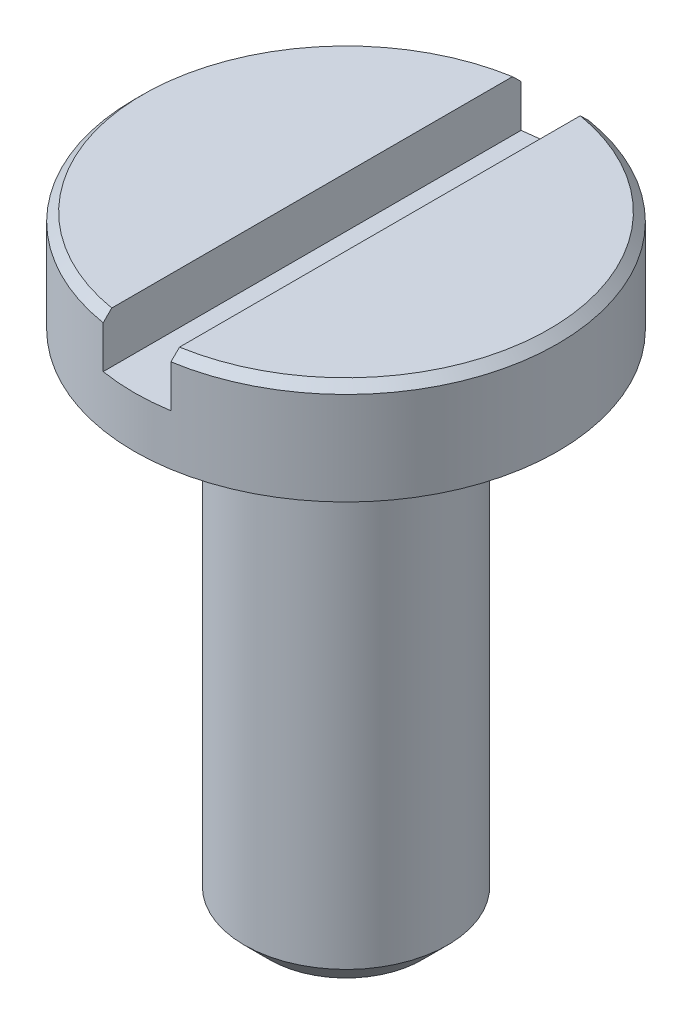
ISO-10303-21;
HEADER;
FILE_DESCRIPTION(('STEP AP214'),'2;1');
FILE_NAME('part.step','',(''),(''),'','','');
FILE_SCHEMA(('AUTOMOTIVE_DESIGN { 1 0 10303 214 1 1 1 1 }'));
ENDSEC;
DATA;
#1=APPLICATION_CONTEXT('core data for automotive mechanical design processes');
#2=APPLICATION_PROTOCOL_DEFINITION('international standard','automotive_design',2000,#1);
#3=PRODUCT_CONTEXT('',#1,'mechanical');
#4=PRODUCT('Part','Part','',(#3));
#5=PRODUCT_RELATED_PRODUCT_CATEGORY('part','',(#4));
#6=PRODUCT_DEFINITION_FORMATION('','',#4);
#7=PRODUCT_DEFINITION_CONTEXT('part definition',#1,'design');
#8=PRODUCT_DEFINITION('design','',#6,#7);
#9=PRODUCT_DEFINITION_SHAPE('','',#8);
#10=(LENGTH_UNIT() NAMED_UNIT(*) SI_UNIT(.MILLI.,.METRE.));
#11=(NAMED_UNIT(*) PLANE_ANGLE_UNIT() SI_UNIT($,.RADIAN.));
#12=(NAMED_UNIT(*) SI_UNIT($,.STERADIAN.) SOLID_ANGLE_UNIT());
#13=UNCERTAINTY_MEASURE_WITH_UNIT(LENGTH_MEASURE(1.E-05),#10,'distance_accuracy_value','');
#14=(GEOMETRIC_REPRESENTATION_CONTEXT(3) GLOBAL_UNCERTAINTY_ASSIGNED_CONTEXT((#13)) GLOBAL_UNIT_ASSIGNED_CONTEXT((#10,
#11,#12)) REPRESENTATION_CONTEXT('',''));
#15=CARTESIAN_POINT('',(0.,0.,0.));
#16=DIRECTION('',(0.,0.,1.));
#17=DIRECTION('',(1.,0.,0.));
#18=AXIS2_PLACEMENT_3D('',#15,#16,#17);
#19=CARTESIAN_POINT('',(0.,0.6,0.));
#20=DIRECTION('',(0.,1.,0.));
#21=DIRECTION('',(0.,0.,1.));
#22=AXIS2_PLACEMENT_3D('',#19,#20,#21);
#23=PLANE('',#22);
#24=DIRECTION('',(0.,0.,1.));
#25=VECTOR('',#24,1.);
#26=CARTESIAN_POINT('',(0.2,0.600000000000045,-1.25));
#27=LINE('',#26,#25);
#28=CARTESIAN_POINT('',(0.2,0.599999999999823,-1.18321595661988));
#29=VERTEX_POINT('',#28);
#30=CARTESIAN_POINT('',(0.2,0.599999999999823,1.18321595661988));
#31=VERTEX_POINT('',#30);
#32=EDGE_CURVE('E103',#29,#31,#27,.T.);
#33=ORIENTED_EDGE('',*,*,#32,.T.);
#34=CARTESIAN_POINT('',(0.,0.6,0.));
#35=DIRECTION('',(0.,1.,0.));
#36=DIRECTION('',(0.,0.,1.));
#37=AXIS2_PLACEMENT_3D('',#34,#35,#36);
#38=CIRCLE('',#37,1.2);
#39=EDGE_CURVE('E106',#31,#29,#38,.T.);
#40=ORIENTED_EDGE('',*,*,#39,.T.);
#41=EDGE_LOOP('',(#33,#40));
#42=FACE_BOUND('',#41,.T.);
#43=ADVANCED_FACE('F35',(#42),#23,.T.);
#44=CARTESIAN_POINT('',(0.,0.6,0.));
#45=DIRECTION('',(0.,-1.,0.));
#46=DIRECTION('',(0.,0.,-1.));
#47=AXIS2_PLACEMENT_3D('',#44,#45,#46);
#48=CONICAL_SURFACE('',#47,1.2,0.78539816339744);
#49=CARTESIAN_POINT('',(0.199999999999886,-0.950499970006001,2.74321892764739));
#50=CARTESIAN_POINT('',(0.199999999999893,-0.85521316276541,2.64767704238701));
#51=CARTESIAN_POINT('',(0.1999999999999,-0.759937513567608,2.55212401485427));
#52=CARTESIAN_POINT('',(0.199999999999914,-0.569420508066631,2.36097790814377));
#53=CARTESIAN_POINT('',(0.199999999999921,-0.474179152911256,2.26538482782206));
#54=CARTESIAN_POINT('',(0.199999999999935,-0.283680304847637,2.07407816347467));
#55=CARTESIAN_POINT('',(0.199999999999942,-0.188422849350493,1.97836454219386));
#56=CARTESIAN_POINT('',(0.199999999999956,0.00200973831289437,1.78686111472408));
#57=CARTESIAN_POINT('',(0.199999999999963,0.0971848728654708,1.69107131090932));
#58=CARTESIAN_POINT('',(0.199999999999977,0.286387712769196,1.50038687319419));
#59=CARTESIAN_POINT('',(0.199999999999984,0.38041680718345,1.40549361733739));
#60=CARTESIAN_POINT('',(0.199999999999998,0.568262322848238,1.2154799344842));
#61=CARTESIAN_POINT('',(0.200000000000005,0.662078724758933,1.12035948832674));
#62=CARTESIAN_POINT('',(0.200000000000015,0.802431191240111,0.977355461478562));
#63=CARTESIAN_POINT('',(0.200000000000018,0.849142887972829,0.929644297742755));
#64=CARTESIAN_POINT('',(0.200000000000025,0.942382748915012,0.834039211918449));
#65=CARTESIAN_POINT('',(0.200000000000029,0.988910906648579,0.786145283496622));
#66=CARTESIAN_POINT('',(0.200000000000035,1.08164699901678,0.690063753270319));
#67=CARTESIAN_POINT('',(0.200000000000039,1.12785498423148,0.641876200221872));
#68=CARTESIAN_POINT('',(0.200000000000046,1.21970773528638,0.544967994387595));
#69=CARTESIAN_POINT('',(0.200000000000049,1.26535254461765,0.496247383322212));
#70=CARTESIAN_POINT('',(0.200000000000053,1.32266782210179,0.433444864484505));
#71=CARTESIAN_POINT('',(0.200000000000054,1.33493377902086,0.41990768719576));
#72=CARTESIAN_POINT('',(0.200000000000056,1.35933321361233,0.392712938428519));
#73=CARTESIAN_POINT('',(0.200000000000057,1.37146668408859,0.37905536048243));
#74=CARTESIAN_POINT('',(0.200000000000059,1.40767513658386,0.337781215528018));
#75=CARTESIAN_POINT('',(0.200000000000061,1.43149053909029,0.309936528051617));
#76=CARTESIAN_POINT('',(0.200000000000064,1.47559765273767,0.255861694886954));
#77=CARTESIAN_POINT('',(0.200000000000066,1.49600843610721,0.229732167365978));
#78=CARTESIAN_POINT('',(0.200000000000068,1.52480518477775,0.18925858421655));
#79=CARTESIAN_POINT('',(0.200000000000069,1.53409437988248,0.175565259020838));
#80=CARTESIAN_POINT('',(0.20000000000007,1.55169168328672,0.147569344104482));
#81=CARTESIAN_POINT('',(0.200000000000071,1.56000099641343,0.133267532647374));
#82=CARTESIAN_POINT('',(0.200000000000072,1.57397551284466,0.105858050008022));
#83=CARTESIAN_POINT('',(0.200000000000072,1.57984745678161,0.0928587110503665));
#84=CARTESIAN_POINT('',(0.200000000000073,1.58969907939955,0.0661702015609263));
#85=CARTESIAN_POINT('',(0.200000000000073,1.5936851853496,0.0524835525617087));
#86=CARTESIAN_POINT('',(0.200000000000073,1.59850989657148,0.0269560064246883));
#87=CARTESIAN_POINT('',(0.200000000000073,1.59976945470394,0.0151985688248418));
#88=CARTESIAN_POINT('',(0.200000000000073,1.6001718043307,-0.00834316835147601));
#89=CARTESIAN_POINT('',(0.200000000000073,1.59931663499625,-0.0201274311120454));
#90=CARTESIAN_POINT('',(0.200000000000073,1.59516364543238,-0.046632359813152));
#91=CARTESIAN_POINT('',(0.200000000000073,1.5912493309678,-0.0612520830681338));
#92=CARTESIAN_POINT('',(0.200000000000072,1.58120047527907,-0.0897419347255407));
#93=CARTESIAN_POINT('',(0.200000000000072,1.57505325105002,-0.103607250128446));
#94=CARTESIAN_POINT('',(0.20000000000007,1.55683264697266,-0.139694012116542));
#95=CARTESIAN_POINT('',(0.200000000000069,1.54354967220904,-0.161283560008565));
#96=CARTESIAN_POINT('',(0.200000000000067,1.51522821534032,-0.203300232330449));
#97=CARTESIAN_POINT('',(0.200000000000066,1.50018421600613,-0.223723388178584));
#98=CARTESIAN_POINT('',(0.200000000000064,1.46906691381076,-0.263969274956352));
#99=CARTESIAN_POINT('',(0.200000000000063,1.45298784001529,-0.283787531009127));
#100=CARTESIAN_POINT('',(0.20000000000006,1.42030678861812,-0.322925503867143));
#101=CARTESIAN_POINT('',(0.200000000000059,1.40370572078283,-0.342245991712319));
#102=CARTESIAN_POINT('',(0.200000000000055,1.35391149998313,-0.399168778706729));
#103=CARTESIAN_POINT('',(0.200000000000053,1.32023024750236,-0.436342661674309));
#104=CARTESIAN_POINT('',(0.200000000000048,1.25224993849167,-0.510122852082956));
#105=CARTESIAN_POINT('',(0.200000000000045,1.2179507934654,-0.546729076802649));
#106=CARTESIAN_POINT('',(0.200000000000038,1.11448679964718,-0.656131274565132));
#107=CARTESIAN_POINT('',(0.200000000000033,1.04481402839601,-0.728446418955601));
#108=CARTESIAN_POINT('',(0.200000000000022,0.905416537934306,-0.872097092656359));
#109=CARTESIAN_POINT('',(0.200000000000017,0.835695199711297,-0.943435937459824));
#110=CARTESIAN_POINT('',(0.200000000000007,0.696002437153473,-1.08581877039426));
#111=CARTESIAN_POINT('',(0.200000000000002,0.626031111422726,-1.15686285505253));
#112=CARTESIAN_POINT('',(0.199999999999988,0.431455983866753,-1.35400414808119));
#113=CARTESIAN_POINT('',(0.199999999999979,0.306690384091999,-1.479941330513));
#114=CARTESIAN_POINT('',(0.19999999999996,0.0569299687690576,-1.73162420971081));
#115=CARTESIAN_POINT('',(0.199999999999951,-0.0680648773181554,-1.85736987615098));
#116=CARTESIAN_POINT('',(0.199999999999932,-0.319268602224971,-2.10984934365665));
#117=CARTESIAN_POINT('',(0.199999999999923,-0.445478504131675,-2.23658212643035));
#118=CARTESIAN_POINT('',(0.199999999999905,-0.697953823574084,-2.48995468743666));
#119=CARTESIAN_POINT('',(0.199999999999895,-0.824219230009358,-2.61659447672912));
#120=CARTESIAN_POINT('',(0.199999999999886,-0.950499970006002,-2.74321892764739));
#121=B_SPLINE_CURVE_WITH_KNOTS('',3,(#49,#50,#51,#52,#53,#54,#55,#56,#57,#58,#59,#60,#61,#62,
#63,#64,#65,#66,#67,#68,#69,#70,#71,#72,#73,#74,#75,#76,#77,#78,#79,#80,#81,#82,#83,#84,#85,#86,
#87,#88,#89,#90,#91,#92,#93,#94,#95,#96,#97,#98,#99,#100,#101,#102,#103,#104,#105,#106,#107,
#108,#109,#110,#111,#112,#113,#114,#115,#116,#117,#118,#119,#120),.UNSPECIFIED.,.F.,.F.,(4,2,2,
2,2,2,2,2,2,2,2,2,2,2,2,2,2,2,2,2,2,2,2,2,2,2,2,2,2,2,2,2,2,2,2,4),(0.,0.404809164288337,
0.809630808762067,1.21474277534173,1.61984257605578,2.02061153496668,2.42141558044582,
2.62172776074122,2.82204694664155,3.02233373006713,3.22260494836593,3.27740738256669,
3.33221277876293,3.44212264151892,3.5415107428698,3.59112809830151,3.64068379549018,
3.68338714841375,3.72594389320615,3.76124040239818,3.79650288944921,3.84163164166431,
3.88702084104461,3.96284904578586,4.03892151808884,4.11546271203283,4.19187718783774,
4.34234648879889,4.492837514494,4.79408069891004,5.0933346910438,5.39248141313244,
5.92430771282928,6.45621092333727,6.99278449758335,7.52927796906916),.UNSPECIFIED.);
#122=CARTESIAN_POINT('',(0.199999999999996,0.549999999999998,1.23389626792531));
#123=VERTEX_POINT('',#122);
#124=EDGE_CURVE('E173',#123,#31,#121,.T.);
#125=ORIENTED_EDGE('',*,*,#124,.F.);
#126=CARTESIAN_POINT('',(0.,0.549999999999998,0.));
#127=DIRECTION('',(0.,1.,0.));
#128=DIRECTION('',(0.,0.,1.));
#129=AXIS2_PLACEMENT_3D('',#126,#127,#128);
#130=CIRCLE('',#129,1.25);
#131=CARTESIAN_POINT('',(0.199999999999996,0.549999999999998,-1.23389626792531));
#132=VERTEX_POINT('',#131);
#133=EDGE_CURVE('E110',#132,#123,#130,.F.);
#134=ORIENTED_EDGE('',*,*,#133,.F.);
#135=EDGE_CURVE('E95',#29,#132,#121,.T.);
#136=ORIENTED_EDGE('',*,*,#135,.F.);
#137=ORIENTED_EDGE('',*,*,#39,.F.);
#138=EDGE_LOOP('',(#125,#134,#136,#137));
#139=FACE_BOUND('',#138,.T.);
#140=ADVANCED_FACE('F157',(#139),#48,.T.);
#141=CARTESIAN_POINT('',(0.,0.6,0.));
#142=DIRECTION('',(0.,-1.,0.));
#143=DIRECTION('',(0.,0.,-1.));
#144=AXIS2_PLACEMENT_3D('',#141,#142,#143);
#145=CYLINDRICAL_SURFACE('',#144,1.25);
#146=CARTESIAN_POINT('',(0.,0.299999999999877,0.));
#147=DIRECTION('',(0.,-1.,0.));
#148=DIRECTION('',(0.,0.,-1.));
#149=AXIS2_PLACEMENT_3D('',#146,#147,#148);
#150=CIRCLE('',#149,1.25);
#151=CARTESIAN_POINT('',(-0.199999999999978,0.299999999999877,-1.23389626792531));
#152=VERTEX_POINT('',#151);
#153=CARTESIAN_POINT('',(0.199999999999978,0.299999999999877,-1.23389626792531));
#154=VERTEX_POINT('',#153);
#155=EDGE_CURVE('E11',#152,#154,#150,.T.);
#156=ORIENTED_EDGE('',*,*,#155,.T.);
#157=DIRECTION('',(0.,-1.,0.));
#158=VECTOR('',#157,1.);
#159=CARTESIAN_POINT('',(0.2,0.599999999999985,-1.23389626792531));
#160=LINE('',#159,#158);
#161=EDGE_CURVE('E183',#154,#132,#160,.F.);
#162=ORIENTED_EDGE('',*,*,#161,.T.);
#163=ORIENTED_EDGE('',*,*,#133,.T.);
#164=DIRECTION('',(0.,-1.,0.));
#165=VECTOR('',#164,1.);
#166=CARTESIAN_POINT('',(0.2,0.599999999999985,1.23389626792531));
#167=LINE('',#166,#165);
#168=CARTESIAN_POINT('',(0.199999999999978,0.299999999999877,1.23389626792531));
#169=VERTEX_POINT('',#168);
#170=EDGE_CURVE('E58',#123,#169,#167,.T.);
#171=ORIENTED_EDGE('',*,*,#170,.T.);
#172=CARTESIAN_POINT('',(-0.199999999999978,0.299999999999877,1.23389626792531));
#173=VERTEX_POINT('',#172);
#174=EDGE_CURVE('E39',#169,#173,#150,.T.);
#175=ORIENTED_EDGE('',*,*,#174,.T.);
#176=DIRECTION('',(0.,-1.,0.));
#177=VECTOR('',#176,1.);
#178=CARTESIAN_POINT('',(-0.2,0.599999999999985,1.23389626792531));
#179=LINE('',#178,#177);
#180=CARTESIAN_POINT('',(-0.199999999999996,0.549999999999998,1.23389626792531));
#181=VERTEX_POINT('',#180);
#182=EDGE_CURVE('E178',#173,#181,#179,.F.);
#183=ORIENTED_EDGE('',*,*,#182,.T.);
#184=CARTESIAN_POINT('',(-0.199999999999996,0.549999999999998,-1.23389626792531));
#185=VERTEX_POINT('',#184);
#186=EDGE_CURVE('E118',#181,#185,#130,.F.);
#187=ORIENTED_EDGE('',*,*,#186,.T.);
#188=DIRECTION('',(0.,-1.,0.));
#189=VECTOR('',#188,1.);
#190=CARTESIAN_POINT('',(-0.2,0.599999999999985,-1.23389626792531));
#191=LINE('',#190,#189);
#192=EDGE_CURVE('E90',#185,#152,#191,.T.);
#193=ORIENTED_EDGE('',*,*,#192,.T.);
#194=EDGE_LOOP('',(#156,#162,#163,#171,#175,#183,#187,#193));
#195=FACE_BOUND('',#194,.T.);
#196=CARTESIAN_POINT('',(0.,0.,0.));
#197=DIRECTION('',(0.,1.,0.));
#198=DIRECTION('',(0.,0.,1.));
#199=AXIS2_PLACEMENT_3D('',#196,#197,#198);
#200=CIRCLE('',#199,1.25);
#201=CARTESIAN_POINT('',(0.,0.,1.25));
#202=VERTEX_POINT('',#201);
#203=EDGE_CURVE('E107',#202,#202,#200,.T.);
#204=ORIENTED_EDGE('',*,*,#203,.T.);
#205=EDGE_LOOP('',(#204));
#206=FACE_BOUND('',#205,.T.);
#207=ADVANCED_FACE('F153',(#195,#206),#145,.T.);
#208=DIRECTION('',(0.,0.,1.));
#209=VECTOR('',#208,1.);
#210=CARTESIAN_POINT('',(-0.2,0.600000000000045,-1.25));
#211=LINE('',#210,#209);
#212=CARTESIAN_POINT('',(-0.2,0.600000000000045,-1.1832159566201));
#213=VERTEX_POINT('',#212);
#214=CARTESIAN_POINT('',(-0.199999999999971,0.6,1.18321595661993));
#215=VERTEX_POINT('',#214);
#216=EDGE_CURVE('E50',#213,#215,#211,.T.);
#217=ORIENTED_EDGE('',*,*,#216,.F.);
#218=EDGE_CURVE('E101',#213,#215,#38,.T.);
#219=ORIENTED_EDGE('',*,*,#218,.T.);
#220=EDGE_LOOP('',(#217,#219));
#221=FACE_BOUND('',#220,.T.);
#222=ADVANCED_FACE('F100',(#221),#23,.T.);
#223=CARTESIAN_POINT('',(0.,0.,0.));
#224=DIRECTION('',(0.,1.,0.));
#225=DIRECTION('',(0.,0.,1.));
#226=AXIS2_PLACEMENT_3D('',#223,#224,#225);
#227=PLANE('',#226);
#228=CARTESIAN_POINT('',(0.,0.,0.));
#229=DIRECTION('',(0.,1.,0.));
#230=DIRECTION('',(0.,0.,1.));
#231=AXIS2_PLACEMENT_3D('',#228,#229,#230);
#232=CIRCLE('',#231,0.6);
#233=CARTESIAN_POINT('',(0.,0.,0.6));
#234=VERTEX_POINT('',#233);
#235=EDGE_CURVE('E112',#234,#234,#232,.T.);
#236=ORIENTED_EDGE('',*,*,#235,.T.);
#237=EDGE_LOOP('',(#236));
#238=FACE_BOUND('',#237,.T.);
#239=ORIENTED_EDGE('',*,*,#203,.F.);
#240=EDGE_LOOP('',(#239));
#241=FACE_BOUND('',#240,.T.);
#242=ADVANCED_FACE('F149',(#238,#241),#227,.F.);
#243=CARTESIAN_POINT('',(0.,-3.,0.));
#244=DIRECTION('',(0.,1.,0.));
#245=DIRECTION('',(0.,0.,1.));
#246=AXIS2_PLACEMENT_3D('',#243,#244,#245);
#247=CYLINDRICAL_SURFACE('',#246,0.6);
#248=CARTESIAN_POINT('',(0.,-2.85,0.));
#249=DIRECTION('',(0.,1.,0.));
#250=DIRECTION('',(0.,0.,1.));
#251=AXIS2_PLACEMENT_3D('',#248,#249,#250);
#252=CIRCLE('',#251,0.6);
#253=CARTESIAN_POINT('',(0.,-2.85,0.6));
#254=VERTEX_POINT('',#253);
#255=EDGE_CURVE('E119',#254,#254,#252,.T.);
#256=ORIENTED_EDGE('',*,*,#255,.T.);
#257=EDGE_LOOP('',(#256));
#258=FACE_BOUND('',#257,.T.);
#259=ORIENTED_EDGE('',*,*,#235,.F.);
#260=EDGE_LOOP('',(#259));
#261=FACE_BOUND('',#260,.T.);
#262=ADVANCED_FACE('F145',(#258,#261),#247,.T.);
#263=CARTESIAN_POINT('',(0.,-3.,0.));
#264=DIRECTION('',(0.,1.,0.));
#265=DIRECTION('',(0.,0.,1.));
#266=AXIS2_PLACEMENT_3D('',#263,#264,#265);
#267=PLANE('',#266);
#268=CARTESIAN_POINT('',(0.,-3.,0.));
#269=DIRECTION('',(0.,1.,0.));
#270=DIRECTION('',(0.,0.,1.));
#271=AXIS2_PLACEMENT_3D('',#268,#269,#270);
#272=CIRCLE('',#271,0.449999999999999);
#273=CARTESIAN_POINT('',(0.,-3.,0.449999999999999));
#274=VERTEX_POINT('',#273);
#275=EDGE_CURVE('E122',#274,#274,#272,.F.);
#276=ORIENTED_EDGE('',*,*,#275,.T.);
#277=EDGE_LOOP('',(#276));
#278=FACE_BOUND('',#277,.T.);
#279=ADVANCED_FACE('F142',(#278),#267,.F.);
#280=CARTESIAN_POINT('',(-0.199999999999886,-0.950499970006001,-2.74321892764739));
#281=CARTESIAN_POINT('',(-0.199999999999893,-0.85521316276541,-2.64767704238701));
#282=CARTESIAN_POINT('',(-0.1999999999999,-0.759937513567608,-2.55212401485427));
#283=CARTESIAN_POINT('',(-0.199999999999914,-0.569420508066631,-2.36097790814377));
#284=CARTESIAN_POINT('',(-0.199999999999921,-0.474179152911257,-2.26538482782206));
#285=CARTESIAN_POINT('',(-0.199999999999935,-0.283680304847639,-2.07407816347467));
#286=CARTESIAN_POINT('',(-0.199999999999942,-0.188422849350494,-1.97836454219386));
#287=CARTESIAN_POINT('',(-0.199999999999956,0.00200973831289268,-1.78686111472408));
#288=CARTESIAN_POINT('',(-0.199999999999963,0.097184872865469,-1.69107131090932));
#289=CARTESIAN_POINT('',(-0.199999999999977,0.286387712769194,-1.5003868731942));
#290=CARTESIAN_POINT('',(-0.199999999999984,0.380416807183448,-1.40549361733739));
#291=CARTESIAN_POINT('',(-0.199999999999998,0.568262322848236,-1.2154799344842));
#292=CARTESIAN_POINT('',(-0.200000000000005,0.662078724758932,-1.12035948832674));
#293=CARTESIAN_POINT('',(-0.200000000000015,0.80243119124011,-0.977355461478563));
#294=CARTESIAN_POINT('',(-0.200000000000018,0.849142887972828,-0.929644297742756));
#295=CARTESIAN_POINT('',(-0.200000000000025,0.942382748915011,-0.83403921191845));
#296=CARTESIAN_POINT('',(-0.200000000000029,0.988910906648578,-0.786145283496623));
#297=CARTESIAN_POINT('',(-0.200000000000035,1.08164699901678,-0.69006375327032));
#298=CARTESIAN_POINT('',(-0.200000000000039,1.12785498423148,-0.641876200221873));
#299=CARTESIAN_POINT('',(-0.200000000000046,1.21970773528638,-0.544967994387596));
#300=CARTESIAN_POINT('',(-0.200000000000049,1.26535254461765,-0.496247383322213));
#301=CARTESIAN_POINT('',(-0.200000000000053,1.32266782210179,-0.433444864484506));
#302=CARTESIAN_POINT('',(-0.200000000000054,1.33493377902085,-0.419907687195761));
#303=CARTESIAN_POINT('',(-0.200000000000056,1.35933321361233,-0.39271293842852));
#304=CARTESIAN_POINT('',(-0.200000000000057,1.37146668408859,-0.37905536048243));
#305=CARTESIAN_POINT('',(-0.200000000000059,1.40767513658386,-0.337781215528018));
#306=CARTESIAN_POINT('',(-0.200000000000061,1.43149053909029,-0.309936528051618));
#307=CARTESIAN_POINT('',(-0.200000000000064,1.47559765273767,-0.255861694886955));
#308=CARTESIAN_POINT('',(-0.200000000000066,1.49600843610721,-0.229732167365978));
#309=CARTESIAN_POINT('',(-0.200000000000068,1.52480518477775,-0.18925858421655));
#310=CARTESIAN_POINT('',(-0.200000000000069,1.53409437988248,-0.175565259020838));
#311=CARTESIAN_POINT('',(-0.20000000000007,1.55169168328672,-0.147569344104481));
#312=CARTESIAN_POINT('',(-0.200000000000071,1.56000099641343,-0.133267532647373));
#313=CARTESIAN_POINT('',(-0.200000000000072,1.57397551284466,-0.105858050008022));
#314=CARTESIAN_POINT('',(-0.200000000000072,1.57984745678161,-0.0928587110503661));
#315=CARTESIAN_POINT('',(-0.200000000000073,1.58969907939955,-0.0661702015609259));
#316=CARTESIAN_POINT('',(-0.200000000000073,1.5936851853496,-0.0524835525617083));
#317=CARTESIAN_POINT('',(-0.200000000000073,1.59850989657148,-0.0269560064246879));
#318=CARTESIAN_POINT('',(-0.200000000000073,1.59976945470394,-0.0151985688248413));
#319=CARTESIAN_POINT('',(-0.200000000000073,1.6001718043307,0.00834316835147648));
#320=CARTESIAN_POINT('',(-0.200000000000073,1.59931663499625,0.0201274311120459));
#321=CARTESIAN_POINT('',(-0.200000000000073,1.59516364543238,0.0466323598131525));
#322=CARTESIAN_POINT('',(-0.200000000000073,1.5912493309678,0.0612520830681344));
#323=CARTESIAN_POINT('',(-0.200000000000072,1.58120047527907,0.0897419347255414));
#324=CARTESIAN_POINT('',(-0.200000000000072,1.57505325105002,0.103607250128447));
#325=CARTESIAN_POINT('',(-0.20000000000007,1.55683264697266,0.139694012116543));
#326=CARTESIAN_POINT('',(-0.200000000000069,1.54354967220904,0.161283560008567));
#327=CARTESIAN_POINT('',(-0.200000000000067,1.51522821534031,0.203300232330451));
#328=CARTESIAN_POINT('',(-0.200000000000066,1.50018421600613,0.223723388178586));
#329=CARTESIAN_POINT('',(-0.200000000000064,1.46906691381076,0.263969274956354));
#330=CARTESIAN_POINT('',(-0.200000000000063,1.45298784001529,0.28378753100913));
#331=CARTESIAN_POINT('',(-0.20000000000006,1.42030678861812,0.322925503867146));
#332=CARTESIAN_POINT('',(-0.200000000000059,1.40370572078283,0.342245991712322));
#333=CARTESIAN_POINT('',(-0.200000000000055,1.35391149998313,0.399168778706733));
#334=CARTESIAN_POINT('',(-0.200000000000053,1.32023024750236,0.436342661674313));
#335=CARTESIAN_POINT('',(-0.200000000000048,1.25224993849166,0.510122852082961));
#336=CARTESIAN_POINT('',(-0.200000000000045,1.21795079346539,0.546729076802654));
#337=CARTESIAN_POINT('',(-0.200000000000038,1.11448679964718,0.656131274565139));
#338=CARTESIAN_POINT('',(-0.200000000000033,1.044814028396,0.728446418955608));
#339=CARTESIAN_POINT('',(-0.200000000000022,0.905416537934298,0.872097092656367));
#340=CARTESIAN_POINT('',(-0.200000000000017,0.835695199711288,0.943435937459833));
#341=CARTESIAN_POINT('',(-0.200000000000007,0.696002437153462,1.08581877039427));
#342=CARTESIAN_POINT('',(-0.200000000000002,0.626031111422714,1.15686285505254));
#343=CARTESIAN_POINT('',(-0.199999999999988,0.431455983866742,1.3540041480812));
#344=CARTESIAN_POINT('',(-0.199999999999979,0.306690384091988,1.47994133051302));
#345=CARTESIAN_POINT('',(-0.19999999999996,0.0569299687690492,1.73162420971082));
#346=CARTESIAN_POINT('',(-0.199999999999951,-0.0680648773181626,1.85736987615099));
#347=CARTESIAN_POINT('',(-0.199999999999932,-0.319268602224977,2.10984934365665));
#348=CARTESIAN_POINT('',(-0.199999999999923,-0.445478504131679,2.23658212643035));
#349=CARTESIAN_POINT('',(-0.199999999999905,-0.697953823574086,2.48995468743666));
#350=CARTESIAN_POINT('',(-0.199999999999895,-0.824219230009359,2.61659447672912));
#351=CARTESIAN_POINT('',(-0.199999999999886,-0.950499970006001,2.74321892764739));
#352=B_SPLINE_CURVE_WITH_KNOTS('',3,(#280,#281,#282,#283,#284,#285,#286,#287,#288,#289,#290,
#291,#292,#293,#294,#295,#296,#297,#298,#299,#300,#301,#302,#303,#304,#305,#306,#307,#308,#309,
#310,#311,#312,#313,#314,#315,#316,#317,#318,#319,#320,#321,#322,#323,#324,#325,#326,#327,#328,
#329,#330,#331,#332,#333,#334,#335,#336,#337,#338,#339,#340,#341,#342,#343,#344,#345,#346,#347,
#348,#349,#350,#351),.UNSPECIFIED.,.F.,.F.,(4,2,2,2,2,2,2,2,2,2,2,2,2,2,2,2,2,2,2,2,2,2,2,2,2,2,
2,2,2,2,2,2,2,2,2,4),(0.,0.404809164288336,0.809630808762066,1.21474277534173,1.61984257605578,
2.02061153496668,2.42141558044582,2.62172776074122,2.82204694664155,3.02233373006713,
3.22260494836593,3.27740738256669,3.33221277876293,3.44212264151892,3.5415107428698,
3.59112809830151,3.64068379549019,3.68338714841375,3.72594389320615,3.76124040239818,
3.79650288944921,3.84163164166431,3.88702084104461,3.96284904578586,4.03892151808884,
4.11546271203284,4.19187718783774,4.34234648879889,4.49283751449401,4.79408069891005,
5.09333469104382,5.39248141313246,5.92430771282929,6.45621092333728,6.99278449758336,
7.52927796906916),.UNSPECIFIED.);
#353=EDGE_CURVE('E86',#185,#213,#352,.T.);
#354=ORIENTED_EDGE('',*,*,#353,.F.);
#355=ORIENTED_EDGE('',*,*,#186,.F.);
#356=EDGE_CURVE('E96',#215,#181,#352,.T.);
#357=ORIENTED_EDGE('',*,*,#356,.F.);
#358=ORIENTED_EDGE('',*,*,#218,.F.);
#359=EDGE_LOOP('',(#354,#355,#357,#358));
#360=FACE_BOUND('',#359,.T.);
#361=ADVANCED_FACE('F105',(#360),#48,.T.);
#362=CARTESIAN_POINT('',(0.,-2.85,0.));
#363=DIRECTION('',(0.,1.,0.));
#364=DIRECTION('',(0.,0.,1.));
#365=AXIS2_PLACEMENT_3D('',#362,#363,#364);
#366=CONICAL_SURFACE('',#365,0.6,0.785398163397451);
#367=ORIENTED_EDGE('',*,*,#275,.F.);
#368=EDGE_LOOP('',(#367));
#369=FACE_BOUND('',#368,.T.);
#370=ORIENTED_EDGE('',*,*,#255,.F.);
#371=EDGE_LOOP('',(#370));
#372=FACE_BOUND('',#371,.T.);
#373=ADVANCED_FACE('F37',(#369,#372),#366,.T.);
#374=CARTESIAN_POINT('',(0.199999999999978,0.299999999999877,-1.25));
#375=DIRECTION('',(0.,-1.,0.));
#376=DIRECTION('',(0.,0.,-1.));
#377=AXIS2_PLACEMENT_3D('',#374,#375,#376);
#378=PLANE('',#377);
#379=DIRECTION('',(0.,0.,1.));
#380=VECTOR('',#379,1.);
#381=CARTESIAN_POINT('',(0.199999999999978,0.299999999999877,-1.25));
#382=LINE('',#381,#380);
#383=EDGE_CURVE('E182',#154,#169,#382,.T.);
#384=ORIENTED_EDGE('',*,*,#383,.F.);
#385=ORIENTED_EDGE('',*,*,#155,.F.);
#386=DIRECTION('',(0.,0.,1.));
#387=VECTOR('',#386,1.);
#388=CARTESIAN_POINT('',(-0.199999999999978,0.299999999999877,-1.25));
#389=LINE('',#388,#387);
#390=EDGE_CURVE('E102',#152,#173,#389,.T.);
#391=ORIENTED_EDGE('',*,*,#390,.T.);
#392=ORIENTED_EDGE('',*,*,#174,.F.);
#393=EDGE_LOOP('',(#384,#385,#391,#392));
#394=FACE_BOUND('',#393,.T.);
#395=ADVANCED_FACE('F138',(#394),#378,.F.);
#396=CARTESIAN_POINT('',(0.2,0.600000000000045,-1.25));
#397=DIRECTION('',(1.,0.,0.));
#398=DIRECTION('',(0.,1.,0.));
#399=AXIS2_PLACEMENT_3D('',#396,#397,#398);
#400=PLANE('',#399);
#401=ORIENTED_EDGE('',*,*,#124,.T.);
#402=ORIENTED_EDGE('',*,*,#32,.F.);
#403=ORIENTED_EDGE('',*,*,#135,.T.);
#404=ORIENTED_EDGE('',*,*,#161,.F.);
#405=ORIENTED_EDGE('',*,*,#383,.T.);
#406=ORIENTED_EDGE('',*,*,#170,.F.);
#407=EDGE_LOOP('',(#401,#402,#403,#404,#405,#406));
#408=FACE_BOUND('',#407,.T.);
#409=ADVANCED_FACE('F137',(#408),#400,.F.);
#410=CARTESIAN_POINT('',(-0.2,0.600000000000045,-1.25));
#411=DIRECTION('',(-1.,0.,0.));
#412=DIRECTION('',(0.,-1.,0.));
#413=AXIS2_PLACEMENT_3D('',#410,#411,#412);
#414=PLANE('',#413);
#415=ORIENTED_EDGE('',*,*,#353,.T.);
#416=ORIENTED_EDGE('',*,*,#216,.T.);
#417=ORIENTED_EDGE('',*,*,#356,.T.);
#418=ORIENTED_EDGE('',*,*,#182,.F.);
#419=ORIENTED_EDGE('',*,*,#390,.F.);
#420=ORIENTED_EDGE('',*,*,#192,.F.);
#421=EDGE_LOOP('',(#415,#416,#417,#418,#419,#420));
#422=FACE_BOUND('',#421,.T.);
#423=ADVANCED_FACE('F87',(#422),#414,.F.);
#424=CLOSED_SHELL('',(#43,#140,#207,#222,#242,#262,#279,#361,#373,#395,#409,#423));
#425=MANIFOLD_SOLID_BREP('B2',#424);
#426=ADVANCED_BREP_SHAPE_REPRESENTATION('',(#18,#425),#14);
#427=SHAPE_DEFINITION_REPRESENTATION(#9,#426);
ENDSEC;
END-ISO-10303-21;
